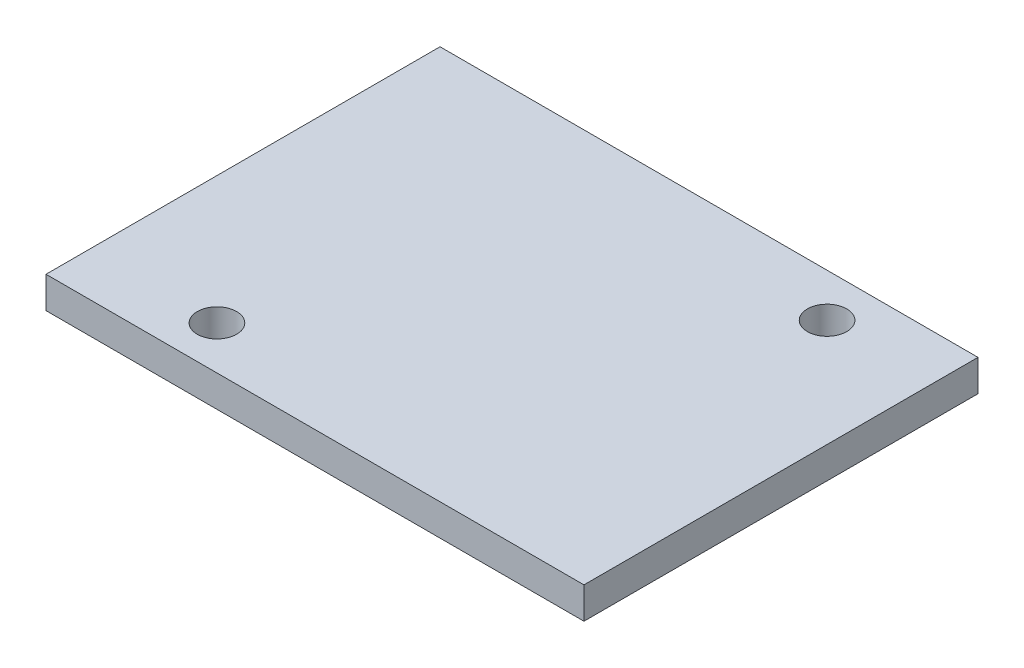
ISO-10303-21;
HEADER;
FILE_DESCRIPTION(('STEP AP214'),'2;1');
FILE_NAME('part.step','',(''),(''),'','','');
FILE_SCHEMA(('AUTOMOTIVE_DESIGN { 1 0 10303 214 1 1 1 1 }'));
ENDSEC;
DATA;
#1=APPLICATION_CONTEXT('core data for automotive mechanical design processes');
#2=APPLICATION_PROTOCOL_DEFINITION('international standard','automotive_design',2000,#1);
#3=PRODUCT_CONTEXT('',#1,'mechanical');
#4=PRODUCT('Part','Part','',(#3));
#5=PRODUCT_RELATED_PRODUCT_CATEGORY('part','',(#4));
#6=PRODUCT_DEFINITION_FORMATION('','',#4);
#7=PRODUCT_DEFINITION_CONTEXT('part definition',#1,'design');
#8=PRODUCT_DEFINITION('design','',#6,#7);
#9=PRODUCT_DEFINITION_SHAPE('','',#8);
#10=(LENGTH_UNIT() NAMED_UNIT(*) SI_UNIT(.MILLI.,.METRE.));
#11=(NAMED_UNIT(*) PLANE_ANGLE_UNIT() SI_UNIT($,.RADIAN.));
#12=(NAMED_UNIT(*) SI_UNIT($,.STERADIAN.) SOLID_ANGLE_UNIT());
#13=UNCERTAINTY_MEASURE_WITH_UNIT(LENGTH_MEASURE(1.E-05),#10,'distance_accuracy_value','');
#14=(GEOMETRIC_REPRESENTATION_CONTEXT(3) GLOBAL_UNCERTAINTY_ASSIGNED_CONTEXT((#13)) GLOBAL_UNIT_ASSIGNED_CONTEXT((#10,
#11,#12)) REPRESENTATION_CONTEXT('',''));
#15=CARTESIAN_POINT('',(0.,0.,0.));
#16=DIRECTION('',(0.,0.,1.));
#17=DIRECTION('',(1.,0.,0.));
#18=AXIS2_PLACEMENT_3D('',#15,#16,#17);
#19=CARTESIAN_POINT('',(13.6525,1.6002,-10.));
#20=DIRECTION('',(-1.,0.,0.));
#21=DIRECTION('',(0.,0.,1.));
#22=AXIS2_PLACEMENT_3D('',#19,#20,#21);
#23=PLANE('',#22);
#24=DIRECTION('',(0.,0.,-1.));
#25=VECTOR('',#24,1.);
#26=CARTESIAN_POINT('',(13.6525,0.,-10.));
#27=LINE('',#26,#25);
#28=CARTESIAN_POINT('',(13.6525,0.,10.));
#29=VERTEX_POINT('',#28);
#30=CARTESIAN_POINT('',(13.6525,0.,-10.));
#31=VERTEX_POINT('',#30);
#32=EDGE_CURVE('E111',#29,#31,#27,.T.);
#33=ORIENTED_EDGE('',*,*,#32,.T.);
#34=DIRECTION('',(0.,-1.,0.));
#35=VECTOR('',#34,1.);
#36=CARTESIAN_POINT('',(13.6525,1.6002,-10.));
#37=LINE('',#36,#35);
#38=CARTESIAN_POINT('',(13.6525,1.6002,-10.));
#39=VERTEX_POINT('',#38);
#40=EDGE_CURVE('E11',#39,#31,#37,.T.);
#41=ORIENTED_EDGE('',*,*,#40,.F.);
#42=DIRECTION('',(0.,0.,-1.));
#43=VECTOR('',#42,1.);
#44=CARTESIAN_POINT('',(13.6525,1.6002,-10.));
#45=LINE('',#44,#43);
#46=CARTESIAN_POINT('',(13.6525,1.6002,10.));
#47=VERTEX_POINT('',#46);
#48=EDGE_CURVE('E95',#47,#39,#45,.T.);
#49=ORIENTED_EDGE('',*,*,#48,.F.);
#50=DIRECTION('',(0.,-1.,0.));
#51=VECTOR('',#50,1.);
#52=CARTESIAN_POINT('',(13.6525,1.6002,10.));
#53=LINE('',#52,#51);
#54=EDGE_CURVE('E107',#47,#29,#53,.T.);
#55=ORIENTED_EDGE('',*,*,#54,.T.);
#56=EDGE_LOOP('',(#33,#41,#49,#55));
#57=FACE_BOUND('',#56,.T.);
#58=ADVANCED_FACE('F43',(#57),#23,.F.);
#59=CARTESIAN_POINT('',(-13.6525,1.6002,-10.));
#60=DIRECTION('',(0.,0.,1.));
#61=DIRECTION('',(1.,0.,0.));
#62=AXIS2_PLACEMENT_3D('',#59,#60,#61);
#63=PLANE('',#62);
#64=DIRECTION('',(-1.,0.,0.));
#65=VECTOR('',#64,1.);
#66=CARTESIAN_POINT('',(-13.6525,0.,-10.));
#67=LINE('',#66,#65);
#68=CARTESIAN_POINT('',(-13.6525,0.,-10.));
#69=VERTEX_POINT('',#68);
#70=EDGE_CURVE('E100',#31,#69,#67,.T.);
#71=ORIENTED_EDGE('',*,*,#70,.T.);
#72=DIRECTION('',(0.,-1.,0.));
#73=VECTOR('',#72,1.);
#74=CARTESIAN_POINT('',(-13.6525,1.6002,-10.));
#75=LINE('',#74,#73);
#76=CARTESIAN_POINT('',(-13.6525,1.6002,-10.));
#77=VERTEX_POINT('',#76);
#78=EDGE_CURVE('E52',#77,#69,#75,.T.);
#79=ORIENTED_EDGE('',*,*,#78,.F.);
#80=DIRECTION('',(-1.,0.,0.));
#81=VECTOR('',#80,1.);
#82=CARTESIAN_POINT('',(-13.6525,1.6002,-10.));
#83=LINE('',#82,#81);
#84=EDGE_CURVE('E90',#39,#77,#83,.T.);
#85=ORIENTED_EDGE('',*,*,#84,.F.);
#86=ORIENTED_EDGE('',*,*,#40,.T.);
#87=EDGE_LOOP('',(#71,#79,#85,#86));
#88=FACE_BOUND('',#87,.T.);
#89=ADVANCED_FACE('F99',(#88),#63,.F.);
#90=CARTESIAN_POINT('',(-13.6525,1.6002,-10.));
#91=DIRECTION('',(1.,0.,0.));
#92=DIRECTION('',(0.,0.,-1.));
#93=AXIS2_PLACEMENT_3D('',#90,#91,#92);
#94=PLANE('',#93);
#95=DIRECTION('',(0.,0.,1.));
#96=VECTOR('',#95,1.);
#97=CARTESIAN_POINT('',(-13.6525,0.,-10.));
#98=LINE('',#97,#96);
#99=CARTESIAN_POINT('',(-13.6525,0.,10.));
#100=VERTEX_POINT('',#99);
#101=EDGE_CURVE('E77',#69,#100,#98,.T.);
#102=ORIENTED_EDGE('',*,*,#101,.T.);
#103=DIRECTION('',(0.,-1.,0.));
#104=VECTOR('',#103,1.);
#105=CARTESIAN_POINT('',(-13.6525,1.6002,10.));
#106=LINE('',#105,#104);
#107=CARTESIAN_POINT('',(-13.6525,1.6002,10.));
#108=VERTEX_POINT('',#107);
#109=EDGE_CURVE('E102',#108,#100,#106,.T.);
#110=ORIENTED_EDGE('',*,*,#109,.F.);
#111=DIRECTION('',(0.,0.,1.));
#112=VECTOR('',#111,1.);
#113=CARTESIAN_POINT('',(-13.6525,1.6002,-10.));
#114=LINE('',#113,#112);
#115=EDGE_CURVE('E93',#77,#108,#114,.T.);
#116=ORIENTED_EDGE('',*,*,#115,.F.);
#117=ORIENTED_EDGE('',*,*,#78,.T.);
#118=EDGE_LOOP('',(#102,#110,#116,#117));
#119=FACE_BOUND('',#118,.T.);
#120=ADVANCED_FACE('F103',(#119),#94,.F.);
#121=CARTESIAN_POINT('',(-13.6525,1.6002,10.));
#122=DIRECTION('',(0.,0.,-1.));
#123=DIRECTION('',(-1.,0.,0.));
#124=AXIS2_PLACEMENT_3D('',#121,#122,#123);
#125=PLANE('',#124);
#126=DIRECTION('',(1.,0.,0.));
#127=VECTOR('',#126,1.);
#128=CARTESIAN_POINT('',(-13.6525,0.,10.));
#129=LINE('',#128,#127);
#130=EDGE_CURVE('E83',#100,#29,#129,.T.);
#131=ORIENTED_EDGE('',*,*,#130,.T.);
#132=ORIENTED_EDGE('',*,*,#54,.F.);
#133=DIRECTION('',(1.,0.,0.));
#134=VECTOR('',#133,1.);
#135=CARTESIAN_POINT('',(-13.6525,1.6002,10.));
#136=LINE('',#135,#134);
#137=EDGE_CURVE('E60',#108,#47,#136,.T.);
#138=ORIENTED_EDGE('',*,*,#137,.F.);
#139=ORIENTED_EDGE('',*,*,#109,.T.);
#140=EDGE_LOOP('',(#131,#132,#138,#139));
#141=FACE_BOUND('',#140,.T.);
#142=ADVANCED_FACE('F125',(#141),#125,.F.);
#143=CARTESIAN_POINT('',(0.,1.6002,0.));
#144=DIRECTION('',(0.,1.,0.));
#145=DIRECTION('',(0.,0.,1.));
#146=AXIS2_PLACEMENT_3D('',#143,#144,#145);
#147=PLANE('',#146);
#148=CARTESIAN_POINT('',(-7.1755,1.6002,7.8));
#149=DIRECTION('',(0.,1.,0.));
#150=DIRECTION('',(0.,0.,1.));
#151=AXIS2_PLACEMENT_3D('',#148,#149,#150);
#152=CIRCLE('',#151,1.);
#153=CARTESIAN_POINT('',(-7.1755,1.6002,8.8));
#154=VERTEX_POINT('',#153);
#155=EDGE_CURVE('E140',#154,#154,#152,.T.);
#156=ORIENTED_EDGE('',*,*,#155,.F.);
#157=EDGE_LOOP('',(#156));
#158=FACE_BOUND('',#157,.T.);
#159=CARTESIAN_POINT('',(8.1915,1.6002,-7.8));
#160=DIRECTION('',(0.,1.,0.));
#161=DIRECTION('',(0.,0.,1.));
#162=AXIS2_PLACEMENT_3D('',#159,#160,#161);
#163=CIRCLE('',#162,0.999999999999999);
#164=CARTESIAN_POINT('',(8.1915,1.6002,-6.8));
#165=VERTEX_POINT('',#164);
#166=EDGE_CURVE('E136',#165,#165,#163,.T.);
#167=ORIENTED_EDGE('',*,*,#166,.F.);
#168=EDGE_LOOP('',(#167));
#169=FACE_BOUND('',#168,.T.);
#170=ORIENTED_EDGE('',*,*,#48,.T.);
#171=ORIENTED_EDGE('',*,*,#84,.T.);
#172=ORIENTED_EDGE('',*,*,#115,.T.);
#173=ORIENTED_EDGE('',*,*,#137,.T.);
#174=EDGE_LOOP('',(#170,#171,#172,#173));
#175=FACE_BOUND('',#174,.T.);
#176=ADVANCED_FACE('F91',(#158,#169,#175),#147,.T.);
#177=CARTESIAN_POINT('',(0.,0.,0.));
#178=DIRECTION('',(0.,1.,0.));
#179=DIRECTION('',(0.,0.,1.));
#180=AXIS2_PLACEMENT_3D('',#177,#178,#179);
#181=PLANE('',#180);
#182=CARTESIAN_POINT('',(-7.1755,0.,7.8));
#183=DIRECTION('',(0.,1.,0.));
#184=DIRECTION('',(0.,0.,1.));
#185=AXIS2_PLACEMENT_3D('',#182,#183,#184);
#186=CIRCLE('',#185,1.);
#187=CARTESIAN_POINT('',(-7.1755,0.,8.8));
#188=VERTEX_POINT('',#187);
#189=EDGE_CURVE('E115',#188,#188,#186,.T.);
#190=ORIENTED_EDGE('',*,*,#189,.T.);
#191=EDGE_LOOP('',(#190));
#192=FACE_BOUND('',#191,.T.);
#193=CARTESIAN_POINT('',(8.1915,0.,-7.8));
#194=DIRECTION('',(0.,1.,0.));
#195=DIRECTION('',(0.,0.,1.));
#196=AXIS2_PLACEMENT_3D('',#193,#194,#195);
#197=CIRCLE('',#196,0.999999999999999);
#198=CARTESIAN_POINT('',(8.1915,0.,-6.8));
#199=VERTEX_POINT('',#198);
#200=EDGE_CURVE('E132',#199,#199,#197,.T.);
#201=ORIENTED_EDGE('',*,*,#200,.T.);
#202=EDGE_LOOP('',(#201));
#203=FACE_BOUND('',#202,.T.);
#204=ORIENTED_EDGE('',*,*,#32,.F.);
#205=ORIENTED_EDGE('',*,*,#130,.F.);
#206=ORIENTED_EDGE('',*,*,#101,.F.);
#207=ORIENTED_EDGE('',*,*,#70,.F.);
#208=EDGE_LOOP('',(#204,#205,#206,#207));
#209=FACE_BOUND('',#208,.T.);
#210=ADVANCED_FACE('F128',(#192,#203,#209),#181,.F.);
#211=CARTESIAN_POINT('',(8.1915,0.,-7.8));
#212=DIRECTION('',(0.,1.,0.));
#213=DIRECTION('',(0.,0.,1.));
#214=AXIS2_PLACEMENT_3D('',#211,#212,#213);
#215=CYLINDRICAL_SURFACE('',#214,0.999999999999999);
#216=ORIENTED_EDGE('',*,*,#200,.F.);
#217=EDGE_LOOP('',(#216));
#218=FACE_BOUND('',#217,.T.);
#219=ORIENTED_EDGE('',*,*,#166,.T.);
#220=EDGE_LOOP('',(#219));
#221=FACE_BOUND('',#220,.T.);
#222=ADVANCED_FACE('F153',(#218,#221),#215,.F.);
#223=CARTESIAN_POINT('',(-7.1755,0.,7.8));
#224=DIRECTION('',(0.,1.,0.));
#225=DIRECTION('',(0.,0.,1.));
#226=AXIS2_PLACEMENT_3D('',#223,#224,#225);
#227=CYLINDRICAL_SURFACE('',#226,1.);
#228=ORIENTED_EDGE('',*,*,#189,.F.);
#229=EDGE_LOOP('',(#228));
#230=FACE_BOUND('',#229,.T.);
#231=ORIENTED_EDGE('',*,*,#155,.T.);
#232=EDGE_LOOP('',(#231));
#233=FACE_BOUND('',#232,.T.);
#234=ADVANCED_FACE('F150',(#230,#233),#227,.F.);
#235=CLOSED_SHELL('',(#58,#89,#120,#142,#176,#210,#222,#234));
#236=MANIFOLD_SOLID_BREP('B2',#235);
#237=ADVANCED_BREP_SHAPE_REPRESENTATION('',(#18,#236),#14);
#238=SHAPE_DEFINITION_REPRESENTATION(#9,#237);
ENDSEC;
END-ISO-10303-21;
